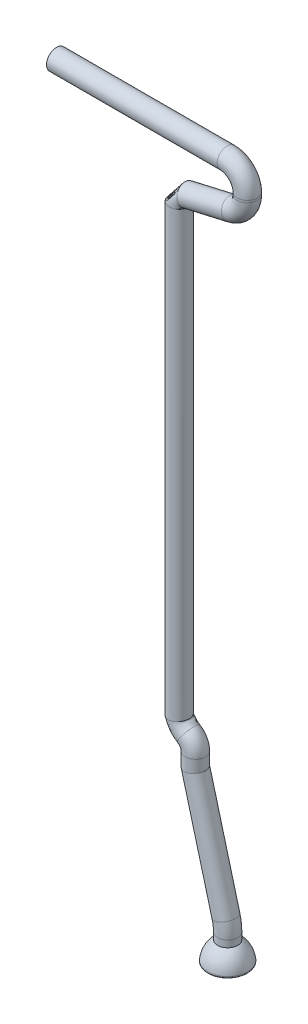
ISO-10303-21;
HEADER;
FILE_DESCRIPTION(('STEP AP214'),'2;1');
FILE_NAME('part.step','',(''),(''),'','','');
FILE_SCHEMA(('AUTOMOTIVE_DESIGN { 1 0 10303 214 1 1 1 1 }'));
ENDSEC;
DATA;
#1=APPLICATION_CONTEXT('core data for automotive mechanical design processes');
#2=APPLICATION_PROTOCOL_DEFINITION('international standard','automotive_design',2000,#1);
#3=PRODUCT_CONTEXT('',#1,'mechanical');
#4=PRODUCT('Part','Part','',(#3));
#5=PRODUCT_RELATED_PRODUCT_CATEGORY('part','',(#4));
#6=PRODUCT_DEFINITION_FORMATION('','',#4);
#7=PRODUCT_DEFINITION_CONTEXT('part definition',#1,'design');
#8=PRODUCT_DEFINITION('design','',#6,#7);
#9=PRODUCT_DEFINITION_SHAPE('','',#8);
#10=(LENGTH_UNIT() NAMED_UNIT(*) SI_UNIT(.MILLI.,.METRE.));
#11=(NAMED_UNIT(*) PLANE_ANGLE_UNIT() SI_UNIT($,.RADIAN.));
#12=(NAMED_UNIT(*) SI_UNIT($,.STERADIAN.) SOLID_ANGLE_UNIT());
#13=UNCERTAINTY_MEASURE_WITH_UNIT(LENGTH_MEASURE(1.E-05),#10,'distance_accuracy_value','');
#14=(GEOMETRIC_REPRESENTATION_CONTEXT(3) GLOBAL_UNCERTAINTY_ASSIGNED_CONTEXT((#13)) GLOBAL_UNIT_ASSIGNED_CONTEXT((#10,
#11,#12)) REPRESENTATION_CONTEXT('',''));
#15=CARTESIAN_POINT('',(0.,0.,0.));
#16=DIRECTION('',(0.,0.,1.));
#17=DIRECTION('',(1.,0.,0.));
#18=AXIS2_PLACEMENT_3D('',#15,#16,#17);
#19=CARTESIAN_POINT('',(14.5384757729335,-40.5165249758739,0.));
#20=DIRECTION('',(0.,-1.,0.));
#21=DIRECTION('',(0.,0.,-1.));
#22=AXIS2_PLACEMENT_3D('',#19,#20,#21);
#23=CYLINDRICAL_SURFACE('',#22,2.49999999999999);
#24=CARTESIAN_POINT('',(14.5384757729335,-40.5165249758739,0.));
#25=DIRECTION('',(0.,-1.,0.));
#26=DIRECTION('',(1.,0.,0.));
#27=AXIS2_PLACEMENT_3D('',#24,#25,#26);
#28=CIRCLE('',#27,2.49999999999999);
#29=CARTESIAN_POINT('',(17.0384757729335,-40.5165249758739,0.));
#30=VERTEX_POINT('',#29);
#31=EDGE_CURVE('E47',#30,#30,#28,.T.);
#32=ORIENTED_EDGE('',*,*,#31,.T.);
#33=EDGE_LOOP('',(#32));
#34=FACE_BOUND('',#33,.T.);
#35=CARTESIAN_POINT('',(14.5384757729335,-42.2,0.));
#36=DIRECTION('',(0.,-1.,0.));
#37=DIRECTION('',(1.,0.,0.));
#38=AXIS2_PLACEMENT_3D('',#35,#36,#37);
#39=CIRCLE('',#38,2.49999999999999);
#40=CARTESIAN_POINT('',(17.0384757729335,-42.2,0.));
#41=VERTEX_POINT('',#40);
#42=EDGE_CURVE('E13',#41,#41,#39,.T.);
#43=ORIENTED_EDGE('',*,*,#42,.F.);
#44=EDGE_LOOP('',(#43));
#45=FACE_BOUND('',#44,.T.);
#46=ADVANCED_FACE('F41',(#34,#45),#23,.T.);
#47=CARTESIAN_POINT('',(2.03847577293351,-40.5165249758739,0.));
#48=DIRECTION('',(0.,0.,-1.));
#49=DIRECTION('',(-1.,0.,0.));
#50=AXIS2_PLACEMENT_3D('',#47,#48,#49);
#51=TOROIDAL_SURFACE('',#50,12.5,2.49999999999999);
#52=CARTESIAN_POINT('',(14.1125486015469,-37.2812869120925,0.));
#53=DIRECTION('',(0.258819045102514,-0.96592582628907,0.));
#54=DIRECTION('',(0.96592582628907,0.258819045102514,0.));
#55=AXIS2_PLACEMENT_3D('',#52,#53,#54);
#56=CIRCLE('',#55,2.49999999999999);
#57=CARTESIAN_POINT('',(16.5273631672695,-36.6342392993362,0.));
#58=VERTEX_POINT('',#57);
#59=EDGE_CURVE('E74',#58,#58,#56,.T.);
#60=CARTESIAN_POINT('',(2.03847577293351,-40.5165249758739,0.));
#61=DIRECTION('',(0.,0.,-1.));
#62=DIRECTION('',(-1.,0.,0.));
#63=AXIS2_PLACEMENT_3D('',#60,#61,#62);
#64=CIRCLE('',#63,15.);
#65=EDGE_CURVE('',#58,#30,#64,.T.);
#66=ORIENTED_EDGE('',*,*,#59,.T.);
#67=ORIENTED_EDGE('',*,*,#31,.F.);
#68=ORIENTED_EDGE('',*,*,#65,.T.);
#69=ORIENTED_EDGE('',*,*,#65,.F.);
#70=EDGE_LOOP('',(#66,#68,#67,#69));
#71=FACE_BOUND('',#70,.T.);
#72=ADVANCED_FACE('F81',(#71),#51,.T.);
#73=CARTESIAN_POINT('',(6.50000000000001,-8.87086875603153,0.));
#74=DIRECTION('',(0.258819045102515,-0.96592582628907,0.));
#75=DIRECTION('',(0.96592582628907,0.258819045102515,0.));
#76=AXIS2_PLACEMENT_3D('',#73,#74,#75);
#77=CYLINDRICAL_SURFACE('',#76,2.49999999999999);
#78=CARTESIAN_POINT('',(6.50000000000001,-8.87086875603153,0.));
#79=DIRECTION('',(0.130526192220048,-0.991444861373811,0.));
#80=DIRECTION('',(-0.991444861373811,-0.130526192220048,0.));
#81=AXIS2_PLACEMENT_3D('',#78,#79,#80);
#82=ELLIPSE('',#81,2.52157240145037,2.49999999999999);
#83=CARTESIAN_POINT('',(4.00000000000002,-9.20000000000001,0.));
#84=VERTEX_POINT('',#83);
#85=EDGE_CURVE('E71',#84,#84,#82,.F.);
#86=ORIENTED_EDGE('',*,*,#85,.F.);
#87=EDGE_LOOP('',(#86));
#88=FACE_BOUND('',#87,.T.);
#89=ORIENTED_EDGE('',*,*,#59,.F.);
#90=EDGE_LOOP('',(#89));
#91=FACE_BOUND('',#90,.T.);
#92=ADVANCED_FACE('F83',(#88,#91),#77,.T.);
#93=CARTESIAN_POINT('',(6.50000000000001,-5.58007283046414,0.));
#94=DIRECTION('',(0.,-1.,0.));
#95=DIRECTION('',(0.,0.,-1.));
#96=AXIS2_PLACEMENT_3D('',#93,#94,#95);
#97=CYLINDRICAL_SURFACE('',#96,2.49999999999999);
#98=CARTESIAN_POINT('',(6.50000000000001,-5.58007283046414,0.));
#99=DIRECTION('',(0.,-1.,0.));
#100=DIRECTION('',(1.,0.,0.));
#101=AXIS2_PLACEMENT_3D('',#98,#99,#100);
#102=CIRCLE('',#101,2.49999999999999);
#103=CARTESIAN_POINT('',(9.,-5.58007283046413,0.));
#104=VERTEX_POINT('',#103);
#105=EDGE_CURVE('E57',#104,#104,#102,.T.);
#106=ORIENTED_EDGE('',*,*,#105,.T.);
#107=EDGE_LOOP('',(#106));
#108=FACE_BOUND('',#107,.T.);
#109=ORIENTED_EDGE('',*,*,#85,.T.);
#110=EDGE_LOOP('',(#109));
#111=FACE_BOUND('',#110,.T.);
#112=ADVANCED_FACE('F89',(#108,#111),#97,.T.);
#113=CARTESIAN_POINT('',(3.00000000000003,-5.58007283046414,0.));
#114=DIRECTION('',(0.,0.,-1.));
#115=DIRECTION('',(-1.,0.,0.));
#116=AXIS2_PLACEMENT_3D('',#113,#114,#115);
#117=TOROIDAL_SURFACE('',#116,3.49999999999998,2.49999999999999);
#118=CARTESIAN_POINT('',(4.83745806223148,-2.60118916883173,0.));
#119=DIRECTION('',(0.851109617609264,-0.524988017780419,0.));
#120=DIRECTION('',(0.524988017780419,0.851109617609264,0.));
#121=AXIS2_PLACEMENT_3D('',#118,#119,#120);
#122=CIRCLE('',#121,2.49999999999999);
#123=CARTESIAN_POINT('',(6.14992810668252,-0.473415124808582,0.));
#124=VERTEX_POINT('',#123);
#125=EDGE_CURVE('E165',#124,#124,#122,.T.);
#126=CARTESIAN_POINT('',(3.00000000000003,-5.58007283046414,0.));
#127=DIRECTION('',(0.,0.,-1.));
#128=DIRECTION('',(-1.,0.,0.));
#129=AXIS2_PLACEMENT_3D('',#126,#127,#128);
#130=CIRCLE('',#129,5.99999999999997);
#131=EDGE_CURVE('',#124,#104,#130,.T.);
#132=ORIENTED_EDGE('',*,*,#125,.T.);
#133=ORIENTED_EDGE('',*,*,#105,.F.);
#134=ORIENTED_EDGE('',*,*,#131,.T.);
#135=ORIENTED_EDGE('',*,*,#131,.F.);
#136=EDGE_LOOP('',(#132,#134,#133,#135));
#137=FACE_BOUND('',#136,.T.);
#138=ADVANCED_FACE('F95',(#137),#117,.T.);
#139=CARTESIAN_POINT('',(2.49999999999997,111.017615984978,0.));
#140=DIRECTION('',(0.,-1.,0.));
#141=DIRECTION('',(0.,0.,-1.));
#142=AXIS2_PLACEMENT_3D('',#139,#140,#141);
#143=CYLINDRICAL_SURFACE('',#142,2.49999999999999);
#144=CARTESIAN_POINT('',(2.49999999999997,111.017615984978,0.));
#145=DIRECTION('',(0.,-1.,0.));
#146=DIRECTION('',(0.,0.,-1.));
#147=AXIS2_PLACEMENT_3D('',#144,#145,#146);
#148=CIRCLE('',#147,2.49999999999999);
#149=CARTESIAN_POINT('',(4.99999999999998,111.017615984978,0.));
#150=VERTEX_POINT('',#149);
#151=EDGE_CURVE('E51',#150,#150,#148,.T.);
#152=ORIENTED_EDGE('',*,*,#151,.T.);
#153=EDGE_LOOP('',(#152));
#154=FACE_BOUND('',#153,.T.);
#155=CARTESIAN_POINT('',(4.99999999999997,0.661344353542473,0.));
#156=CARTESIAN_POINT('',(4.99999999999996,0.661344353542473,-4.99999999999998));
#157=CARTESIAN_POINT('',(0.,0.,-4.99999999999998));
#158=CARTESIAN_POINT('',(0.,0.,0.));
#159=CARTESIAN_POINT('',(0.,0.,4.99999999999998));
#160=CARTESIAN_POINT('',(4.99999999999997,0.661344353542473,4.99999999999998));
#161=CARTESIAN_POINT('',(4.99999999999997,0.661344353542473,0.));
#162=(BOUNDED_CURVE() B_SPLINE_CURVE(3,(#155,#156,#157,#158,#159,#160,#161),.UNSPECIFIED.,.T.,
.F.) B_SPLINE_CURVE_WITH_KNOTS((4,3,4),(0.,0.5,1.),
.UNSPECIFIED.) CURVE() GEOMETRIC_REPRESENTATION_ITEM() RATIONAL_B_SPLINE_CURVE((1.,
0.333333333333333,0.333333333333333,1.,0.333333333333333,0.333333333333333,1.)) REPRESENTATION_ITEM(''));
#163=CARTESIAN_POINT('',(4.99999999999997,0.661344353542473,0.));
#164=VERTEX_POINT('',#163);
#165=EDGE_CURVE('E158',#164,#164,#162,.T.);
#166=ORIENTED_EDGE('',*,*,#165,.T.);
#167=EDGE_LOOP('',(#166));
#168=FACE_BOUND('',#167,.T.);
#169=ADVANCED_FACE('F53',(#154,#168),#143,.T.);
#170=CARTESIAN_POINT('',(5.,111.017615984978,0.));
#171=DIRECTION('',(0.,0.,1.));
#172=DIRECTION('',(1.,0.,0.));
#173=AXIS2_PLACEMENT_3D('',#170,#171,#172);
#174=TOROIDAL_SURFACE('',#173,2.50000000000003,2.49999999999999);
#175=CARTESIAN_POINT('',(4.44072713472685,113.454255856229,0.));
#176=DIRECTION('',(-0.974655948500326,-0.223709146109252,0.));
#177=DIRECTION('',(0.,0.,-1.));
#178=AXIS2_PLACEMENT_3D('',#175,#176,#177);
#179=CIRCLE('',#178,2.49999999999999);
#180=EDGE_CURVE('E58',#150,#150,#179,.T.);
#181=ORIENTED_EDGE('',*,*,#180,.T.);
#182=ORIENTED_EDGE('',*,*,#151,.F.);
#183=EDGE_LOOP('',(#181,#182));
#184=FACE_BOUND('',#183,.T.);
#185=ADVANCED_FACE('F60',(#184),#174,.T.);
#186=CARTESIAN_POINT('',(15.5518427046747,116.004548788108,0.));
#187=DIRECTION('',(-0.974655948500325,-0.223709146109252,0.));
#188=DIRECTION('',(0.223709146109252,-0.974655948500326,0.));
#189=AXIS2_PLACEMENT_3D('',#186,#187,#188);
#190=CYLINDRICAL_SURFACE('',#189,2.49999999999999);
#191=CARTESIAN_POINT('',(15.5518427046747,116.004548788108,0.));
#192=DIRECTION('',(-0.974655948500326,-0.223709146109252,0.));
#193=DIRECTION('',(0.,0.,-1.));
#194=AXIS2_PLACEMENT_3D('',#191,#192,#193);
#195=CIRCLE('',#194,2.49999999999999);
#196=CARTESIAN_POINT('',(16.1111155699479,113.567908916857,0.));
#197=VERTEX_POINT('',#196);
#198=EDGE_CURVE('E62',#197,#197,#195,.T.);
#199=ORIENTED_EDGE('',*,*,#198,.T.);
#200=EDGE_LOOP('',(#199));
#201=FACE_BOUND('',#200,.T.);
#202=ORIENTED_EDGE('',*,*,#180,.F.);
#203=EDGE_LOOP('',(#202));
#204=FACE_BOUND('',#203,.T.);
#205=ADVANCED_FACE('F104',(#201,#204),#190,.T.);
#206=CARTESIAN_POINT('',(14.4332969741285,120.87782853061,0.));
#207=DIRECTION('',(0.,0.,-1.));
#208=DIRECTION('',(-1.,0.,0.));
#209=AXIS2_PLACEMENT_3D('',#206,#207,#208);
#210=TOROIDAL_SURFACE('',#209,4.99999999999998,2.49999999999999);
#211=CARTESIAN_POINT('',(19.4332969741285,120.87782853061,0.));
#212=DIRECTION('',(0.,-1.,0.));
#213=DIRECTION('',(0.,0.,-1.));
#214=AXIS2_PLACEMENT_3D('',#211,#212,#213);
#215=CIRCLE('',#214,2.49999999999999);
#216=CARTESIAN_POINT('',(21.9332969741285,120.87782853061,0.));
#217=VERTEX_POINT('',#216);
#218=EDGE_CURVE('E65',#217,#217,#215,.T.);
#219=CARTESIAN_POINT('',(14.4332969741285,120.87782853061,0.));
#220=DIRECTION('',(0.,0.,-1.));
#221=DIRECTION('',(-1.,0.,0.));
#222=AXIS2_PLACEMENT_3D('',#219,#220,#221);
#223=CIRCLE('',#222,7.49999999999997);
#224=EDGE_CURVE('',#217,#197,#223,.T.);
#225=ORIENTED_EDGE('',*,*,#218,.T.);
#226=ORIENTED_EDGE('',*,*,#198,.F.);
#227=ORIENTED_EDGE('',*,*,#224,.T.);
#228=ORIENTED_EDGE('',*,*,#224,.F.);
#229=EDGE_LOOP('',(#225,#227,#226,#228));
#230=FACE_BOUND('',#229,.T.);
#231=ADVANCED_FACE('F107',(#230),#210,.T.);
#232=CARTESIAN_POINT('',(19.4332969741285,121.386636523099,0.));
#233=DIRECTION('',(0.,-1.,0.));
#234=DIRECTION('',(0.,0.,-1.));
#235=AXIS2_PLACEMENT_3D('',#232,#233,#234);
#236=CYLINDRICAL_SURFACE('',#235,2.49999999999999);
#237=CARTESIAN_POINT('',(19.4332969741285,121.386636523099,0.));
#238=DIRECTION('',(0.,-1.,0.));
#239=DIRECTION('',(0.,0.,-1.));
#240=AXIS2_PLACEMENT_3D('',#237,#238,#239);
#241=CIRCLE('',#240,2.49999999999999);
#242=CARTESIAN_POINT('',(21.9332969741285,121.386636523099,0.));
#243=VERTEX_POINT('',#242);
#244=EDGE_CURVE('E175',#243,#243,#241,.T.);
#245=ORIENTED_EDGE('',*,*,#244,.T.);
#246=EDGE_LOOP('',(#245));
#247=FACE_BOUND('',#246,.T.);
#248=ORIENTED_EDGE('',*,*,#218,.F.);
#249=EDGE_LOOP('',(#248));
#250=FACE_BOUND('',#249,.T.);
#251=ADVANCED_FACE('F111',(#247,#250),#236,.T.);
#252=CARTESIAN_POINT('',(14.4332969741285,121.386636523099,0.));
#253=DIRECTION('',(0.,0.,-1.));
#254=DIRECTION('',(-1.,0.,0.));
#255=AXIS2_PLACEMENT_3D('',#252,#253,#254);
#256=TOROIDAL_SURFACE('',#255,4.99999999999999,2.49999999999999);
#257=CARTESIAN_POINT('',(14.4332969741285,126.386636523099,0.));
#258=DIRECTION('',(1.,0.,0.));
#259=DIRECTION('',(0.,0.,-1.));
#260=AXIS2_PLACEMENT_3D('',#257,#258,#259);
#261=CIRCLE('',#260,2.49999999999999);
#262=CARTESIAN_POINT('',(14.4332969741285,128.886636523099,0.));
#263=VERTEX_POINT('',#262);
#264=EDGE_CURVE('E172',#263,#263,#261,.T.);
#265=CARTESIAN_POINT('',(14.4332969741285,121.386636523099,0.));
#266=DIRECTION('',(0.,0.,-1.));
#267=DIRECTION('',(-1.,0.,0.));
#268=AXIS2_PLACEMENT_3D('',#265,#266,#267);
#269=CIRCLE('',#268,7.49999999999998);
#270=EDGE_CURVE('',#263,#243,#269,.T.);
#271=ORIENTED_EDGE('',*,*,#264,.T.);
#272=ORIENTED_EDGE('',*,*,#244,.F.);
#273=ORIENTED_EDGE('',*,*,#270,.T.);
#274=ORIENTED_EDGE('',*,*,#270,.F.);
#275=EDGE_LOOP('',(#271,#273,#272,#274));
#276=FACE_BOUND('',#275,.T.);
#277=ADVANCED_FACE('F115',(#276),#256,.T.);
#278=CARTESIAN_POINT('',(14.4332969741285,126.386636523099,0.));
#279=DIRECTION('',(-1.,0.,0.));
#280=DIRECTION('',(0.,0.,1.));
#281=AXIS2_PLACEMENT_3D('',#278,#279,#280);
#282=CYLINDRICAL_SURFACE('',#281,2.49999999999999);
#283=ORIENTED_EDGE('',*,*,#264,.F.);
#284=EDGE_LOOP('',(#283));
#285=FACE_BOUND('',#284,.T.);
#286=CARTESIAN_POINT('',(-28.0667030258715,126.386636523099,0.));
#287=DIRECTION('',(1.,0.,0.));
#288=DIRECTION('',(0.,0.,-1.));
#289=AXIS2_PLACEMENT_3D('',#286,#287,#288);
#290=CIRCLE('',#289,2.49999999999999);
#291=CARTESIAN_POINT('',(-28.0667030258715,126.386636523099,-2.49999999999999));
#292=VERTEX_POINT('',#291);
#293=EDGE_CURVE('E171',#292,#292,#290,.T.);
#294=ORIENTED_EDGE('',*,*,#293,.T.);
#295=EDGE_LOOP('',(#294));
#296=FACE_BOUND('',#295,.T.);
#297=ADVANCED_FACE('F119',(#285,#296),#282,.T.);
#298=CARTESIAN_POINT('',(-28.0667030258715,126.386636523099,0.));
#299=DIRECTION('',(1.,0.,0.));
#300=DIRECTION('',(0.,0.,-1.));
#301=AXIS2_PLACEMENT_3D('',#298,#299,#300);
#302=PLANE('',#301);
#303=ORIENTED_EDGE('',*,*,#293,.F.);
#304=EDGE_LOOP('',(#303));
#305=FACE_BOUND('',#304,.T.);
#306=ADVANCED_FACE('F123',(#305),#302,.F.);
#307=CARTESIAN_POINT('',(4.99999999999997,0.661344353542473,0.));
#308=CARTESIAN_POINT('',(5.09342875409255,0.31434580245455,0.));
#309=CARTESIAN_POINT('',(5.27775533986298,0.358120059973208,0.));
#310=CARTESIAN_POINT('',(5.55771369306094,-0.0633598801821715,0.));
#311=CARTESIAN_POINT('',(5.94206200015745,-0.327915632549423,0.));
#312=CARTESIAN_POINT('',(5.9171602671454,-0.32983746553494,0.));
#313=CARTESIAN_POINT('',(6.14992810668252,-0.473415124808583,0.));
#314=CARTESIAN_POINT('',(4.99999999999996,0.661344353542473,-4.99999999999998));
#315=CARTESIAN_POINT('',(5.24880282737219,-0.262720421196903,-4.99999999999998));
#316=CARTESIAN_POINT('',(5.22686957816135,0.617469563909078,-4.99999999999998));
#317=CARTESIAN_POINT('',(5.50022233848552,-0.0739907628382071,-4.99999999999998));
#318=CARTESIAN_POINT('',(6.1369984757209,-0.436830606906832,-4.99999999999998));
#319=CARTESIAN_POINT('',(5.49727002850553,-0.0708375206299673,-4.99999999999998));
#320=CARTESIAN_POINT('',(6.14992810668252,-0.473415124808585,-4.99999999999998));
#321=CARTESIAN_POINT('',(0.,0.,-4.99999999999998));
#322=CARTESIAN_POINT('',(0.248802827372209,-0.924064774739385,-4.99999999999998));
#323=CARTESIAN_POINT('',(0.520019898361593,-1.4205895785544,-4.99999999999998));
#324=CARTESIAN_POINT('',(1.37272026997733,-2.92040010740489,-4.99999999999998));
#325=CARTESIAN_POINT('',(2.56291743473023,-4.03889350068667,-4.99999999999998));
#326=CARTESIAN_POINT('',(2.87232993960345,-4.32638560867627,-4.99999999999998));
#327=CARTESIAN_POINT('',(3.52498801778044,-4.72896321285488,-4.99999999999998));
#328=CARTESIAN_POINT('',(0.,0.,0.));
#329=CARTESIAN_POINT('',(0.171115790732387,-0.635531662913659,0.));
#330=CARTESIAN_POINT('',(0.545462779212408,-1.55026433052234,0.));
#331=CARTESIAN_POINT('',(1.40146594726504,-2.91508466607688,0.));
#332=CARTESIAN_POINT('',(2.4654491969485,-3.98443601350796,0.));
#333=CARTESIAN_POINT('',(3.08227505892339,-4.45588558112875,0.));
#334=CARTESIAN_POINT('',(3.52498801778044,-4.72896321285488,0.));
#335=CARTESIAN_POINT('',(0.,0.,4.99999999999998));
#336=CARTESIAN_POINT('',(0.0934287540925652,-0.346998551087933,4.99999999999998));
#337=CARTESIAN_POINT('',(0.570905660063223,-1.67993908249027,4.99999999999998));
#338=CARTESIAN_POINT('',(1.43021162455275,-2.90976922474886,4.99999999999998));
#339=CARTESIAN_POINT('',(2.36798095916678,-3.92997852632926,4.99999999999998));
#340=CARTESIAN_POINT('',(3.29222017824332,-4.58538555358124,4.99999999999998));
#341=CARTESIAN_POINT('',(3.52498801778044,-4.72896321285488,4.99999999999998));
#342=CARTESIAN_POINT('',(4.99999999999997,0.661344353542473,4.99999999999998));
#343=CARTESIAN_POINT('',(4.9380546808129,0.891412026106003,4.99999999999998));
#344=CARTESIAN_POINT('',(5.32864110156461,0.098770556037336,4.99999999999998));
#345=CARTESIAN_POINT('',(5.61520504763635,-0.0527289975261354,4.99999999999998));
#346=CARTESIAN_POINT('',(5.747125524594,-0.219000658192014,4.99999999999998));
#347=CARTESIAN_POINT('',(6.33705050578528,-0.588837410439915,4.99999999999998));
#348=CARTESIAN_POINT('',(6.14992810668253,-0.473415124808583,4.99999999999998));
#349=CARTESIAN_POINT('',(4.99999999999997,0.661344353542473,0.));
#350=CARTESIAN_POINT('',(5.09342875409255,0.31434580245455,0.));
#351=CARTESIAN_POINT('',(5.27775533986298,0.358120059973208,0.));
#352=CARTESIAN_POINT('',(5.55771369306094,-0.0633598801821715,0.));
#353=CARTESIAN_POINT('',(5.94206200015745,-0.327915632549423,0.));
#354=CARTESIAN_POINT('',(5.9171602671454,-0.32983746553494,0.));
#355=CARTESIAN_POINT('',(6.14992810668252,-0.473415124808583,0.));
#356=(BOUNDED_SURFACE() B_SPLINE_SURFACE(3,3,((#307,#308,#309,#310,#311,#312,#313),(#314,#315,
#316,#317,#318,#319,#320),(#321,#322,#323,#324,#325,#326,#327),(#328,#329,#330,#331,#332,#333,
#334),(#335,#336,#337,#338,#339,#340,#341),(#342,#343,#344,#345,#346,#347,#348),(#349,#350,#351,
#352,#353,#354,#355)),.UNSPECIFIED.,.T.,.F.,.F.) B_SPLINE_SURFACE_WITH_KNOTS((4,3,4),(4,1,1,1,
4),(0.,0.5,1.),(0.,0.282354404311687,0.56745608018004,0.786680189524266,1.),
.UNSPECIFIED.) GEOMETRIC_REPRESENTATION_ITEM() RATIONAL_B_SPLINE_SURFACE(((1.,1.,1.,1.,1.,1.,
1.),(0.333333333333333,0.333333333333333,0.333333333333333,0.333333333333333,0.333333333333333,
0.333333333333333,0.333333333333333),(0.333333333333333,0.333333333333333,0.333333333333333,
0.333333333333333,0.333333333333333,0.333333333333333,0.333333333333333),(1.,1.,1.,1.,1.,1.,1.),
(0.333333333333333,0.333333333333333,0.333333333333333,0.333333333333333,0.333333333333333,
0.333333333333333,0.333333333333333),(0.333333333333333,0.333333333333333,0.333333333333333,
0.333333333333333,0.333333333333333,0.333333333333333,0.333333333333333),(1.,1.,1.,1.,1.,1.,1.))) REPRESENTATION_ITEM('') SURFACE());
#357=ORIENTED_EDGE('',*,*,#165,.F.);
#358=EDGE_LOOP('',(#357));
#359=FACE_BOUND('',#358,.T.);
#360=ORIENTED_EDGE('',*,*,#125,.F.);
#361=EDGE_LOOP('',(#360));
#362=FACE_BOUND('',#361,.T.);
#363=ADVANCED_FACE('F127',(#359,#362),#356,.F.);
#364=CARTESIAN_POINT('',(14.5384757729335,-47.2,0.));
#365=DIRECTION('',(0.,1.,0.));
#366=DIRECTION('',(0.,0.,1.));
#367=AXIS2_PLACEMENT_3D('',#364,#365,#366);
#368=DEGENERATE_TOROIDAL_SURFACE('',#367,1.2500000000001,6.25000000000001,.F.);
#369=CARTESIAN_POINT('',(14.5384757729335,-46.6565217391305,0.));
#370=DIRECTION('',(0.,1.,0.));
#371=DIRECTION('',(0.,0.,1.));
#372=AXIS2_PLACEMENT_3D('',#369,#370,#371);
#373=CIRCLE('',#372,4.97632567249426);
#374=CARTESIAN_POINT('',(14.5384757729335,-46.6565217391305,4.97632567249426));
#375=VERTEX_POINT('',#374);
#376=EDGE_CURVE('E155',#375,#375,#373,.T.);
#377=ORIENTED_EDGE('',*,*,#376,.T.);
#378=EDGE_LOOP('',(#377));
#379=FACE_BOUND('',#378,.T.);
#380=ORIENTED_EDGE('',*,*,#42,.T.);
#381=EDGE_LOOP('',(#380));
#382=FACE_BOUND('',#381,.T.);
#383=ADVANCED_FACE('F133',(#379,#382),#368,.F.);
#384=CARTESIAN_POINT('',(14.5384757729335,-46.7,0.));
#385=DIRECTION('',(0.,1.,0.));
#386=DIRECTION('',(0.,0.,1.));
#387=AXIS2_PLACEMENT_3D('',#384,#385,#386);
#388=TOROIDAL_SURFACE('',#387,4.47821961869471,0.5);
#389=CARTESIAN_POINT('',(14.5384757729335,-47.2,0.));
#390=DIRECTION('',(0.,1.,0.));
#391=DIRECTION('',(0.,0.,1.));
#392=AXIS2_PLACEMENT_3D('',#389,#390,#391);
#393=CIRCLE('',#392,4.47821961869471);
#394=CARTESIAN_POINT('',(14.5384757729335,-47.2,4.47821961869471));
#395=VERTEX_POINT('',#394);
#396=EDGE_CURVE('E154',#395,#395,#393,.T.);
#397=ORIENTED_EDGE('',*,*,#396,.T.);
#398=EDGE_LOOP('',(#397));
#399=FACE_BOUND('',#398,.T.);
#400=ORIENTED_EDGE('',*,*,#376,.F.);
#401=EDGE_LOOP('',(#400));
#402=FACE_BOUND('',#401,.T.);
#403=ADVANCED_FACE('F142',(#399,#402),#388,.T.);
#404=CARTESIAN_POINT('',(14.5384757729335,-47.2,0.));
#405=DIRECTION('',(0.,-1.,0.));
#406=DIRECTION('',(0.,0.,-1.));
#407=AXIS2_PLACEMENT_3D('',#404,#405,#406);
#408=PLANE('',#407);
#409=ORIENTED_EDGE('',*,*,#396,.F.);
#410=EDGE_LOOP('',(#409));
#411=FACE_BOUND('',#410,.T.);
#412=ADVANCED_FACE('F146',(#411),#408,.T.);
#413=CLOSED_SHELL('',(#46,#72,#92,#112,#138,#169,#185,#205,#231,#251,#277,#297,#306,#363,#383,
#403,#412));
#414=MANIFOLD_SOLID_BREP('B2',#413);
#415=ADVANCED_BREP_SHAPE_REPRESENTATION('',(#18,#414),#14);
#416=SHAPE_DEFINITION_REPRESENTATION(#9,#415);
ENDSEC;
END-ISO-10303-21;
